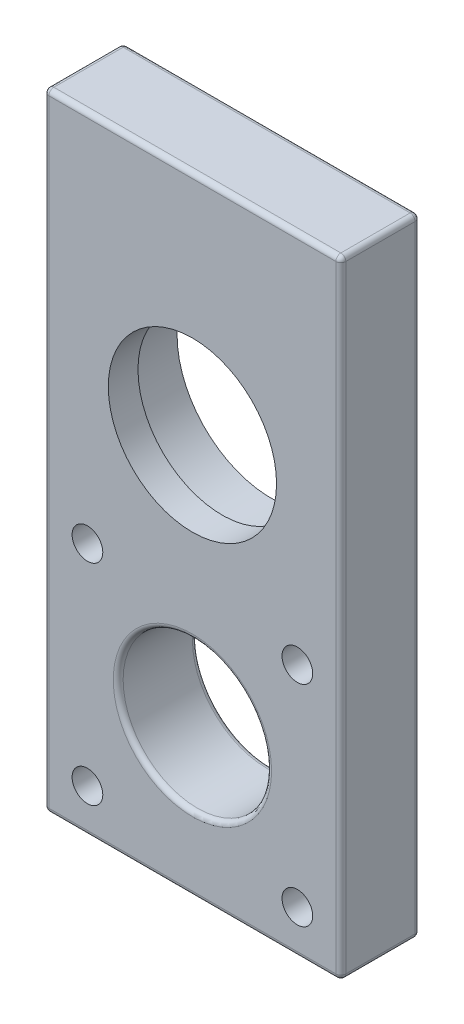
ISO-10303-21;
HEADER;
FILE_DESCRIPTION(('STEP AP214'),'2;1');
FILE_NAME('part.step','',(''),(''),'','','');
FILE_SCHEMA(('AUTOMOTIVE_DESIGN { 1 0 10303 214 1 1 1 1 }'));
ENDSEC;
DATA;
#1=APPLICATION_CONTEXT('core data for automotive mechanical design processes');
#2=APPLICATION_PROTOCOL_DEFINITION('international standard','automotive_design',2000,#1);
#3=PRODUCT_CONTEXT('',#1,'mechanical');
#4=PRODUCT('Part','Part','',(#3));
#5=PRODUCT_RELATED_PRODUCT_CATEGORY('part','',(#4));
#6=PRODUCT_DEFINITION_FORMATION('','',#4);
#7=PRODUCT_DEFINITION_CONTEXT('part definition',#1,'design');
#8=PRODUCT_DEFINITION('design','',#6,#7);
#9=PRODUCT_DEFINITION_SHAPE('','',#8);
#10=(LENGTH_UNIT() NAMED_UNIT(*) SI_UNIT(.MILLI.,.METRE.));
#11=(NAMED_UNIT(*) PLANE_ANGLE_UNIT() SI_UNIT($,.RADIAN.));
#12=(NAMED_UNIT(*) SI_UNIT($,.STERADIAN.) SOLID_ANGLE_UNIT());
#13=UNCERTAINTY_MEASURE_WITH_UNIT(LENGTH_MEASURE(1.E-05),#10,'distance_accuracy_value','');
#14=(GEOMETRIC_REPRESENTATION_CONTEXT(3) GLOBAL_UNCERTAINTY_ASSIGNED_CONTEXT((#13)) GLOBAL_UNIT_ASSIGNED_CONTEXT((#10,
#11,#12)) REPRESENTATION_CONTEXT('',''));
#15=CARTESIAN_POINT('',(0.,0.,0.));
#16=DIRECTION('',(0.,0.,1.));
#17=DIRECTION('',(1.,0.,0.));
#18=AXIS2_PLACEMENT_3D('',#15,#16,#17);
#19=CARTESIAN_POINT('',(10.6066017177984,10.6066017177987,-2.));
#20=DIRECTION('',(0.,0.,1.));
#21=DIRECTION('',(1.,0.,0.));
#22=AXIS2_PLACEMENT_3D('',#19,#20,#21);
#23=CYLINDRICAL_SURFACE('',#22,1.55000000000007);
#24=CARTESIAN_POINT('',(10.6066017177984,10.6066017177987,8.));
#25=DIRECTION('',(0.,0.,1.));
#26=DIRECTION('',(1.,0.,0.));
#27=AXIS2_PLACEMENT_3D('',#24,#25,#26);
#28=CIRCLE('',#27,1.55000000000007);
#29=CARTESIAN_POINT('',(12.1566017177985,10.6066017177987,8.));
#30=VERTEX_POINT('',#29);
#31=EDGE_CURVE('E196',#30,#30,#28,.T.);
#32=ORIENTED_EDGE('',*,*,#31,.T.);
#33=EDGE_LOOP('',(#32));
#34=FACE_BOUND('',#33,.T.);
#35=CARTESIAN_POINT('',(10.6066017177984,10.6066017177987,2.55));
#36=DIRECTION('',(0.,0.,-1.));
#37=DIRECTION('',(-1.,0.,0.));
#38=AXIS2_PLACEMENT_3D('',#35,#36,#37);
#39=CIRCLE('',#38,1.55000000000007);
#40=CARTESIAN_POINT('',(9.05660171779833,10.6066017177987,2.55));
#41=VERTEX_POINT('',#40);
#42=EDGE_CURVE('E41',#41,#41,#39,.F.);
#43=ORIENTED_EDGE('',*,*,#42,.F.);
#44=EDGE_LOOP('',(#43));
#45=FACE_BOUND('',#44,.T.);
#46=ADVANCED_FACE('F37',(#34,#45),#23,.F.);
#47=CARTESIAN_POINT('',(10.6066017177993,-10.6066017177978,-2.));
#48=DIRECTION('',(0.,0.,1.));
#49=DIRECTION('',(1.,0.,0.));
#50=AXIS2_PLACEMENT_3D('',#47,#48,#49);
#51=CYLINDRICAL_SURFACE('',#50,1.55000000000098);
#52=CARTESIAN_POINT('',(10.6066017177993,-10.6066017177978,8.));
#53=DIRECTION('',(0.,0.,1.));
#54=DIRECTION('',(1.,0.,0.));
#55=AXIS2_PLACEMENT_3D('',#52,#53,#54);
#56=CIRCLE('',#55,1.55000000000098);
#57=CARTESIAN_POINT('',(12.1566017178003,-10.6066017177978,8.));
#58=VERTEX_POINT('',#57);
#59=EDGE_CURVE('E303',#58,#58,#56,.T.);
#60=ORIENTED_EDGE('',*,*,#59,.T.);
#61=EDGE_LOOP('',(#60));
#62=FACE_BOUND('',#61,.T.);
#63=CARTESIAN_POINT('',(10.6066017177993,-10.6066017177978,2.55));
#64=DIRECTION('',(0.,0.,-1.));
#65=DIRECTION('',(-1.,0.,0.));
#66=AXIS2_PLACEMENT_3D('',#63,#64,#65);
#67=CIRCLE('',#66,1.55000000000098);
#68=CARTESIAN_POINT('',(9.05660171779832,-10.6066017177978,2.55));
#69=VERTEX_POINT('',#68);
#70=EDGE_CURVE('E283',#69,#69,#67,.F.);
#71=ORIENTED_EDGE('',*,*,#70,.F.);
#72=EDGE_LOOP('',(#71));
#73=FACE_BOUND('',#72,.T.);
#74=ADVANCED_FACE('F328',(#62,#73),#51,.F.);
#75=CARTESIAN_POINT('',(-10.6066017177971,-10.6066017177987,-2.));
#76=DIRECTION('',(0.,0.,1.));
#77=DIRECTION('',(1.,0.,0.));
#78=AXIS2_PLACEMENT_3D('',#75,#76,#77);
#79=CYLINDRICAL_SURFACE('',#78,1.5500000000013);
#80=CARTESIAN_POINT('',(-10.6066017177971,-10.6066017177987,8.));
#81=DIRECTION('',(0.,0.,1.));
#82=DIRECTION('',(1.,0.,0.));
#83=AXIS2_PLACEMENT_3D('',#80,#81,#82);
#84=CIRCLE('',#83,1.5500000000013);
#85=CARTESIAN_POINT('',(-9.05660171779583,-10.6066017177987,8.));
#86=VERTEX_POINT('',#85);
#87=EDGE_CURVE('E306',#86,#86,#84,.T.);
#88=ORIENTED_EDGE('',*,*,#87,.T.);
#89=EDGE_LOOP('',(#88));
#90=FACE_BOUND('',#89,.T.);
#91=CARTESIAN_POINT('',(-10.6066017177971,-10.6066017177987,2.55));
#92=DIRECTION('',(0.,0.,-1.));
#93=DIRECTION('',(-1.,0.,0.));
#94=AXIS2_PLACEMENT_3D('',#91,#92,#93);
#95=CIRCLE('',#94,1.5500000000013);
#96=CARTESIAN_POINT('',(-12.1566017177984,-10.6066017177987,2.55));
#97=VERTEX_POINT('',#96);
#98=EDGE_CURVE('E280',#97,#97,#95,.F.);
#99=ORIENTED_EDGE('',*,*,#98,.F.);
#100=EDGE_LOOP('',(#99));
#101=FACE_BOUND('',#100,.T.);
#102=ADVANCED_FACE('F333',(#90,#101),#79,.F.);
#103=CARTESIAN_POINT('',(-10.606601717798,10.6066017177978,-2.));
#104=DIRECTION('',(0.,0.,1.));
#105=DIRECTION('',(1.,0.,0.));
#106=AXIS2_PLACEMENT_3D('',#103,#104,#105);
#107=CYLINDRICAL_SURFACE('',#106,1.55000000000049);
#108=CARTESIAN_POINT('',(-10.606601717798,10.6066017177978,8.));
#109=DIRECTION('',(0.,0.,1.));
#110=DIRECTION('',(1.,0.,0.));
#111=AXIS2_PLACEMENT_3D('',#108,#109,#110);
#112=CIRCLE('',#111,1.55000000000049);
#113=CARTESIAN_POINT('',(-9.05660171779754,10.6066017177978,8.));
#114=VERTEX_POINT('',#113);
#115=EDGE_CURVE('E272',#114,#114,#112,.T.);
#116=ORIENTED_EDGE('',*,*,#115,.T.);
#117=EDGE_LOOP('',(#116));
#118=FACE_BOUND('',#117,.T.);
#119=CARTESIAN_POINT('',(-10.606601717798,10.6066017177978,2.55));
#120=DIRECTION('',(0.,0.,-1.));
#121=DIRECTION('',(-1.,0.,0.));
#122=AXIS2_PLACEMENT_3D('',#119,#120,#121);
#123=CIRCLE('',#122,1.55000000000049);
#124=CARTESIAN_POINT('',(-12.1566017177985,10.6066017177978,2.55));
#125=VERTEX_POINT('',#124);
#126=EDGE_CURVE('E277',#125,#125,#123,.F.);
#127=ORIENTED_EDGE('',*,*,#126,.F.);
#128=EDGE_LOOP('',(#127));
#129=FACE_BOUND('',#128,.T.);
#130=ADVANCED_FACE('F311',(#118,#129),#107,.F.);
#131=CARTESIAN_POINT('',(0.,25.4,12.));
#132=DIRECTION('',(0.,0.,-1.));
#133=DIRECTION('',(-1.,0.,0.));
#134=AXIS2_PLACEMENT_3D('',#131,#132,#133);
#135=CYLINDRICAL_SURFACE('',#134,8.5);
#136=CARTESIAN_POINT('',(0.,25.4,8.));
#137=DIRECTION('',(0.,0.,1.));
#138=DIRECTION('',(1.,0.,0.));
#139=AXIS2_PLACEMENT_3D('',#136,#137,#138);
#140=CIRCLE('',#139,8.5);
#141=CARTESIAN_POINT('',(8.5,25.4,8.));
#142=VERTEX_POINT('',#141);
#143=EDGE_CURVE('E253',#142,#142,#140,.T.);
#144=ORIENTED_EDGE('',*,*,#143,.T.);
#145=EDGE_LOOP('',(#144));
#146=FACE_BOUND('',#145,.T.);
#147=CARTESIAN_POINT('',(0.,25.4,5.));
#148=DIRECTION('',(0.,0.,-1.));
#149=DIRECTION('',(-1.,0.,0.));
#150=AXIS2_PLACEMENT_3D('',#147,#148,#149);
#151=CIRCLE('',#150,8.5);
#152=CARTESIAN_POINT('',(-8.5,25.4,5.));
#153=VERTEX_POINT('',#152);
#154=EDGE_CURVE('E273',#153,#153,#151,.F.);
#155=ORIENTED_EDGE('',*,*,#154,.F.);
#156=EDGE_LOOP('',(#155));
#157=FACE_BOUND('',#156,.T.);
#158=ADVANCED_FACE('F345',(#146,#157),#135,.F.);
#159=CARTESIAN_POINT('',(-15.,-15.,8.));
#160=DIRECTION('',(-1.,0.,0.));
#161=DIRECTION('',(0.,0.,1.));
#162=AXIS2_PLACEMENT_3D('',#159,#160,#161);
#163=PLANE('',#162);
#164=DIRECTION('',(0.,1.,0.));
#165=VECTOR('',#164,1.);
#166=CARTESIAN_POINT('',(-15.,-15.,7.5));
#167=LINE('',#166,#165);
#168=CARTESIAN_POINT('',(-15.,-14.5,7.5));
#169=VERTEX_POINT('',#168);
#170=CARTESIAN_POINT('',(-15.,47.84,7.5));
#171=VERTEX_POINT('',#170);
#172=EDGE_CURVE('E160',#169,#171,#167,.T.);
#173=ORIENTED_EDGE('',*,*,#172,.T.);
#174=DIRECTION('',(0.,0.,1.));
#175=VECTOR('',#174,1.);
#176=CARTESIAN_POINT('',(-15.,47.84,0.5));
#177=LINE('',#176,#175);
#178=CARTESIAN_POINT('',(-15.,47.84,0.5));
#179=VERTEX_POINT('',#178);
#180=EDGE_CURVE('E245',#171,#179,#177,.F.);
#181=ORIENTED_EDGE('',*,*,#180,.T.);
#182=DIRECTION('',(0.,1.,0.));
#183=VECTOR('',#182,1.);
#184=CARTESIAN_POINT('',(-15.,-15.,0.5));
#185=LINE('',#184,#183);
#186=CARTESIAN_POINT('',(-15.,-14.5,0.5));
#187=VERTEX_POINT('',#186);
#188=EDGE_CURVE('E168',#179,#187,#185,.F.);
#189=ORIENTED_EDGE('',*,*,#188,.T.);
#190=DIRECTION('',(0.,0.,-1.));
#191=VECTOR('',#190,1.);
#192=CARTESIAN_POINT('',(-15.,-14.5,8.));
#193=LINE('',#192,#191);
#194=EDGE_CURVE('E166',#187,#169,#193,.F.);
#195=ORIENTED_EDGE('',*,*,#194,.T.);
#196=EDGE_LOOP('',(#173,#181,#189,#195));
#197=FACE_BOUND('',#196,.T.);
#198=ADVANCED_FACE('F317',(#197),#163,.T.);
#199=CARTESIAN_POINT('',(0.,0.,8.));
#200=DIRECTION('',(0.,0.,1.));
#201=DIRECTION('',(1.,0.,0.));
#202=AXIS2_PLACEMENT_3D('',#199,#200,#201);
#203=PLANE('',#202);
#204=ORIENTED_EDGE('',*,*,#143,.F.);
#205=EDGE_LOOP('',(#204));
#206=FACE_BOUND('',#205,.T.);
#207=DIRECTION('',(0.,1.,0.));
#208=VECTOR('',#207,1.);
#209=CARTESIAN_POINT('',(14.5,49.,8.));
#210=LINE('',#209,#208);
#211=CARTESIAN_POINT('',(14.5,-14.5,8.));
#212=VERTEX_POINT('',#211);
#213=CARTESIAN_POINT('',(14.5,47.84,8.));
#214=VERTEX_POINT('',#213);
#215=EDGE_CURVE('E179',#212,#214,#210,.T.);
#216=ORIENTED_EDGE('',*,*,#215,.T.);
#217=DIRECTION('',(1.,0.,0.));
#218=VECTOR('',#217,1.);
#219=CARTESIAN_POINT('',(-14.5,47.84,8.));
#220=LINE('',#219,#218);
#221=CARTESIAN_POINT('',(-14.5,47.84,8.));
#222=VERTEX_POINT('',#221);
#223=EDGE_CURVE('E241',#214,#222,#220,.F.);
#224=ORIENTED_EDGE('',*,*,#223,.T.);
#225=DIRECTION('',(0.,1.,0.));
#226=VECTOR('',#225,1.);
#227=CARTESIAN_POINT('',(-14.5,0.,8.));
#228=LINE('',#227,#226);
#229=CARTESIAN_POINT('',(-14.5,-14.5,8.));
#230=VERTEX_POINT('',#229);
#231=EDGE_CURVE('E182',#222,#230,#228,.F.);
#232=ORIENTED_EDGE('',*,*,#231,.T.);
#233=DIRECTION('',(1.,0.,0.));
#234=VECTOR('',#233,1.);
#235=CARTESIAN_POINT('',(15.,-14.5,8.));
#236=LINE('',#235,#234);
#237=EDGE_CURVE('E184',#230,#212,#236,.T.);
#238=ORIENTED_EDGE('',*,*,#237,.T.);
#239=EDGE_LOOP('',(#216,#224,#232,#238));
#240=FACE_BOUND('',#239,.T.);
#241=CARTESIAN_POINT('',(0.,0.,8.));
#242=DIRECTION('',(0.,0.,1.));
#243=DIRECTION('',(1.,0.,0.));
#244=AXIS2_PLACEMENT_3D('',#241,#242,#243);
#245=CIRCLE('',#244,8.);
#246=CARTESIAN_POINT('',(8.,0.,8.));
#247=VERTEX_POINT('',#246);
#248=EDGE_CURVE('E224',#247,#247,#245,.F.);
#249=ORIENTED_EDGE('',*,*,#248,.T.);
#250=EDGE_LOOP('',(#249));
#251=FACE_BOUND('',#250,.T.);
#252=ORIENTED_EDGE('',*,*,#115,.F.);
#253=EDGE_LOOP('',(#252));
#254=FACE_BOUND('',#253,.T.);
#255=ORIENTED_EDGE('',*,*,#87,.F.);
#256=EDGE_LOOP('',(#255));
#257=FACE_BOUND('',#256,.T.);
#258=ORIENTED_EDGE('',*,*,#59,.F.);
#259=EDGE_LOOP('',(#258));
#260=FACE_BOUND('',#259,.T.);
#261=ORIENTED_EDGE('',*,*,#31,.F.);
#262=EDGE_LOOP('',(#261));
#263=FACE_BOUND('',#262,.T.);
#264=ADVANCED_FACE('F314',(#206,#240,#251,#254,#257,#260,#263),#203,.T.);
#265=CARTESIAN_POINT('',(0.,0.,0.));
#266=DIRECTION('',(0.,0.,1.));
#267=DIRECTION('',(1.,0.,0.));
#268=AXIS2_PLACEMENT_3D('',#265,#266,#267);
#269=PLANE('',#268);
#270=CARTESIAN_POINT('',(10.6066017177993,-10.6066017177978,0.));
#271=DIRECTION('',(0.,0.,-1.));
#272=DIRECTION('',(-1.,0.,0.));
#273=AXIS2_PLACEMENT_3D('',#270,#271,#272);
#274=CIRCLE('',#273,2.825);
#275=CARTESIAN_POINT('',(7.7816017177993,-10.6066017177978,0.));
#276=VERTEX_POINT('',#275);
#277=EDGE_CURVE('E696',#276,#276,#274,.T.);
#278=ORIENTED_EDGE('',*,*,#277,.F.);
#279=EDGE_LOOP('',(#278));
#280=FACE_BOUND('',#279,.T.);
#281=CARTESIAN_POINT('',(-10.6066017177971,-10.6066017177987,0.));
#282=DIRECTION('',(0.,0.,-1.));
#283=DIRECTION('',(-1.,0.,0.));
#284=AXIS2_PLACEMENT_3D('',#281,#282,#283);
#285=CIRCLE('',#284,2.825);
#286=CARTESIAN_POINT('',(-13.4316017177971,-10.6066017177987,0.));
#287=VERTEX_POINT('',#286);
#288=EDGE_CURVE('E702',#287,#287,#285,.T.);
#289=ORIENTED_EDGE('',*,*,#288,.F.);
#290=EDGE_LOOP('',(#289));
#291=FACE_BOUND('',#290,.T.);
#292=CARTESIAN_POINT('',(-10.606601717798,10.6066017177978,0.));
#293=DIRECTION('',(0.,0.,-1.));
#294=DIRECTION('',(-1.,0.,0.));
#295=AXIS2_PLACEMENT_3D('',#292,#293,#294);
#296=CIRCLE('',#295,2.825);
#297=CARTESIAN_POINT('',(-13.431601717798,10.6066017177978,0.));
#298=VERTEX_POINT('',#297);
#299=EDGE_CURVE('E693',#298,#298,#296,.T.);
#300=ORIENTED_EDGE('',*,*,#299,.F.);
#301=EDGE_LOOP('',(#300));
#302=FACE_BOUND('',#301,.T.);
#303=CARTESIAN_POINT('',(10.6066017177984,10.6066017177987,0.));
#304=DIRECTION('',(0.,0.,-1.));
#305=DIRECTION('',(-1.,0.,0.));
#306=AXIS2_PLACEMENT_3D('',#303,#304,#305);
#307=CIRCLE('',#306,2.825);
#308=CARTESIAN_POINT('',(7.7816017177984,10.6066017177987,0.));
#309=VERTEX_POINT('',#308);
#310=EDGE_CURVE('E688',#309,#309,#307,.T.);
#311=ORIENTED_EDGE('',*,*,#310,.F.);
#312=EDGE_LOOP('',(#311));
#313=FACE_BOUND('',#312,.T.);
#314=CARTESIAN_POINT('',(0.,25.4,0.));
#315=DIRECTION('',(0.,0.,-1.));
#316=DIRECTION('',(-1.,0.,0.));
#317=AXIS2_PLACEMENT_3D('',#314,#315,#316);
#318=CIRCLE('',#317,9.55);
#319=CARTESIAN_POINT('',(-9.55,25.4,0.));
#320=VERTEX_POINT('',#319);
#321=EDGE_CURVE('E288',#320,#320,#318,.T.);
#322=ORIENTED_EDGE('',*,*,#321,.F.);
#323=EDGE_LOOP('',(#322));
#324=FACE_BOUND('',#323,.T.);
#325=CARTESIAN_POINT('',(0.,0.,0.));
#326=DIRECTION('',(0.,0.,1.));
#327=DIRECTION('',(1.,0.,0.));
#328=AXIS2_PLACEMENT_3D('',#325,#326,#327);
#329=CIRCLE('',#328,8.);
#330=CARTESIAN_POINT('',(8.,0.,0.));
#331=VERTEX_POINT('',#330);
#332=EDGE_CURVE('E192',#331,#331,#329,.T.);
#333=ORIENTED_EDGE('',*,*,#332,.T.);
#334=EDGE_LOOP('',(#333));
#335=FACE_BOUND('',#334,.T.);
#336=DIRECTION('',(0.,1.,0.));
#337=VECTOR('',#336,1.);
#338=CARTESIAN_POINT('',(-14.5,49.,0.));
#339=LINE('',#338,#337);
#340=CARTESIAN_POINT('',(-14.5,-14.5,0.));
#341=VERTEX_POINT('',#340);
#342=CARTESIAN_POINT('',(-14.5,47.84,0.));
#343=VERTEX_POINT('',#342);
#344=EDGE_CURVE('E158',#341,#343,#339,.T.);
#345=ORIENTED_EDGE('',*,*,#344,.T.);
#346=DIRECTION('',(-1.,0.,0.));
#347=VECTOR('',#346,1.);
#348=CARTESIAN_POINT('',(0.,47.84,0.));
#349=LINE('',#348,#347);
#350=CARTESIAN_POINT('',(14.5,47.84,0.));
#351=VERTEX_POINT('',#350);
#352=EDGE_CURVE('E46',#343,#351,#349,.F.);
#353=ORIENTED_EDGE('',*,*,#352,.T.);
#354=DIRECTION('',(0.,1.,0.));
#355=VECTOR('',#354,1.);
#356=CARTESIAN_POINT('',(14.5,0.,0.));
#357=LINE('',#356,#355);
#358=CARTESIAN_POINT('',(14.5,-14.5,0.));
#359=VERTEX_POINT('',#358);
#360=EDGE_CURVE('E125',#351,#359,#357,.F.);
#361=ORIENTED_EDGE('',*,*,#360,.T.);
#362=DIRECTION('',(1.,0.,0.));
#363=VECTOR('',#362,1.);
#364=CARTESIAN_POINT('',(0.,-14.5,0.));
#365=LINE('',#364,#363);
#366=EDGE_CURVE('E129',#359,#341,#365,.F.);
#367=ORIENTED_EDGE('',*,*,#366,.T.);
#368=EDGE_LOOP('',(#345,#353,#361,#367));
#369=FACE_BOUND('',#368,.T.);
#370=ADVANCED_FACE('F127',(#280,#291,#302,#313,#324,#335,#369),#269,.F.);
#371=CARTESIAN_POINT('',(-15.,-15.,8.));
#372=DIRECTION('',(0.,1.,0.));
#373=DIRECTION('',(0.,0.,1.));
#374=AXIS2_PLACEMENT_3D('',#371,#372,#373);
#375=PLANE('',#374);
#376=DIRECTION('',(1.,0.,0.));
#377=VECTOR('',#376,1.);
#378=CARTESIAN_POINT('',(-15.,-15.,7.5));
#379=LINE('',#378,#377);
#380=CARTESIAN_POINT('',(14.5,-15.,7.5));
#381=VERTEX_POINT('',#380);
#382=CARTESIAN_POINT('',(-14.5,-15.,7.5));
#383=VERTEX_POINT('',#382);
#384=EDGE_CURVE('E172',#381,#383,#379,.F.);
#385=ORIENTED_EDGE('',*,*,#384,.T.);
#386=DIRECTION('',(0.,0.,-1.));
#387=VECTOR('',#386,1.);
#388=CARTESIAN_POINT('',(-14.5,-15.,0.));
#389=LINE('',#388,#387);
#390=CARTESIAN_POINT('',(-14.5,-15.,0.5));
#391=VERTEX_POINT('',#390);
#392=EDGE_CURVE('E176',#383,#391,#389,.T.);
#393=ORIENTED_EDGE('',*,*,#392,.T.);
#394=DIRECTION('',(1.,0.,0.));
#395=VECTOR('',#394,1.);
#396=CARTESIAN_POINT('',(-15.,-15.,0.5));
#397=LINE('',#396,#395);
#398=CARTESIAN_POINT('',(14.5,-15.,0.5));
#399=VERTEX_POINT('',#398);
#400=EDGE_CURVE('E174',#391,#399,#397,.T.);
#401=ORIENTED_EDGE('',*,*,#400,.T.);
#402=DIRECTION('',(0.,0.,-1.));
#403=VECTOR('',#402,1.);
#404=CARTESIAN_POINT('',(14.5,-15.,8.));
#405=LINE('',#404,#403);
#406=EDGE_CURVE('E170',#399,#381,#405,.F.);
#407=ORIENTED_EDGE('',*,*,#406,.T.);
#408=EDGE_LOOP('',(#385,#393,#401,#407));
#409=FACE_BOUND('',#408,.T.);
#410=ADVANCED_FACE('F354',(#409),#375,.F.);
#411=CARTESIAN_POINT('',(15.,-15.,8.));
#412=DIRECTION('',(-1.,0.,0.));
#413=DIRECTION('',(0.,0.,1.));
#414=AXIS2_PLACEMENT_3D('',#411,#412,#413);
#415=PLANE('',#414);
#416=DIRECTION('',(0.,1.,0.));
#417=VECTOR('',#416,1.);
#418=CARTESIAN_POINT('',(15.,-15.,0.5));
#419=LINE('',#418,#417);
#420=CARTESIAN_POINT('',(15.,-14.5,0.5));
#421=VERTEX_POINT('',#420);
#422=CARTESIAN_POINT('',(15.,47.84,0.5));
#423=VERTEX_POINT('',#422);
#424=EDGE_CURVE('E141',#421,#423,#419,.T.);
#425=ORIENTED_EDGE('',*,*,#424,.T.);
#426=DIRECTION('',(0.,0.,-1.));
#427=VECTOR('',#426,1.);
#428=CARTESIAN_POINT('',(15.,47.84,8.));
#429=LINE('',#428,#427);
#430=CARTESIAN_POINT('',(15.,47.84,7.5));
#431=VERTEX_POINT('',#430);
#432=EDGE_CURVE('E236',#423,#431,#429,.F.);
#433=ORIENTED_EDGE('',*,*,#432,.T.);
#434=DIRECTION('',(0.,1.,0.));
#435=VECTOR('',#434,1.);
#436=CARTESIAN_POINT('',(15.,-15.,7.5));
#437=LINE('',#436,#435);
#438=CARTESIAN_POINT('',(15.,-14.5,7.5));
#439=VERTEX_POINT('',#438);
#440=EDGE_CURVE('E190',#431,#439,#437,.F.);
#441=ORIENTED_EDGE('',*,*,#440,.T.);
#442=DIRECTION('',(0.,0.,-1.));
#443=VECTOR('',#442,1.);
#444=CARTESIAN_POINT('',(15.,-14.5,8.));
#445=LINE('',#444,#443);
#446=EDGE_CURVE('E188',#439,#421,#445,.T.);
#447=ORIENTED_EDGE('',*,*,#446,.T.);
#448=EDGE_LOOP('',(#425,#433,#441,#447));
#449=FACE_BOUND('',#448,.T.);
#450=ADVANCED_FACE('F359',(#449),#415,.F.);
#451=CARTESIAN_POINT('',(14.5,0.,7.5));
#452=DIRECTION('',(0.,-1.,0.));
#453=DIRECTION('',(0.,0.,-1.));
#454=AXIS2_PLACEMENT_3D('',#451,#452,#453);
#455=CYLINDRICAL_SURFACE('',#454,0.5);
#456=ORIENTED_EDGE('',*,*,#440,.F.);
#457=CARTESIAN_POINT('',(14.5,47.84,7.5));
#458=DIRECTION('',(0.,-1.,0.));
#459=DIRECTION('',(0.,0.,-1.));
#460=AXIS2_PLACEMENT_3D('',#457,#458,#459);
#461=CIRCLE('',#460,0.5);
#462=EDGE_CURVE('E238',#431,#214,#461,.T.);
#463=ORIENTED_EDGE('',*,*,#462,.T.);
#464=ORIENTED_EDGE('',*,*,#215,.F.);
#465=CARTESIAN_POINT('',(14.5,-14.5,7.5));
#466=DIRECTION('',(0.,-1.,0.));
#467=DIRECTION('',(0.,0.,-1.));
#468=AXIS2_PLACEMENT_3D('',#465,#466,#467);
#469=CIRCLE('',#468,0.5);
#470=EDGE_CURVE('E133',#439,#212,#469,.T.);
#471=ORIENTED_EDGE('',*,*,#470,.F.);
#472=EDGE_LOOP('',(#456,#463,#464,#471));
#473=FACE_BOUND('',#472,.T.);
#474=ADVANCED_FACE('F362',(#473),#455,.T.);
#475=CARTESIAN_POINT('',(14.5,-14.5,7.5));
#476=DIRECTION('',(0.,0.,1.));
#477=DIRECTION('',(1.,0.,0.));
#478=AXIS2_PLACEMENT_3D('',#475,#476,#477);
#479=SPHERICAL_SURFACE('',#478,0.5);
#480=CARTESIAN_POINT('',(14.5,-14.5,7.5));
#481=DIRECTION('',(0.,0.,1.));
#482=DIRECTION('',(1.,0.,0.));
#483=AXIS2_PLACEMENT_3D('',#480,#481,#482);
#484=CIRCLE('',#483,0.5);
#485=EDGE_CURVE('E209',#439,#381,#484,.F.);
#486=ORIENTED_EDGE('',*,*,#485,.F.);
#487=ORIENTED_EDGE('',*,*,#470,.T.);
#488=CARTESIAN_POINT('',(14.5,-14.5,7.5));
#489=DIRECTION('',(1.,0.,0.));
#490=DIRECTION('',(0.,0.,-1.));
#491=AXIS2_PLACEMENT_3D('',#488,#489,#490);
#492=CIRCLE('',#491,0.5);
#493=EDGE_CURVE('E212',#381,#212,#492,.F.);
#494=ORIENTED_EDGE('',*,*,#493,.F.);
#495=EDGE_LOOP('',(#486,#487,#494));
#496=FACE_BOUND('',#495,.T.);
#497=ADVANCED_FACE('F398',(#496),#479,.T.);
#498=CARTESIAN_POINT('',(-14.5,-15.,7.5));
#499=DIRECTION('',(0.,1.,0.));
#500=DIRECTION('',(0.,0.,1.));
#501=AXIS2_PLACEMENT_3D('',#498,#499,#500);
#502=CYLINDRICAL_SURFACE('',#501,0.5);
#503=ORIENTED_EDGE('',*,*,#231,.F.);
#504=CARTESIAN_POINT('',(-14.5,47.84,7.5));
#505=DIRECTION('',(0.,1.,0.));
#506=DIRECTION('',(0.,0.,1.));
#507=AXIS2_PLACEMENT_3D('',#504,#505,#506);
#508=CIRCLE('',#507,0.5);
#509=EDGE_CURVE('E243',#222,#171,#508,.F.);
#510=ORIENTED_EDGE('',*,*,#509,.T.);
#511=ORIENTED_EDGE('',*,*,#172,.F.);
#512=CARTESIAN_POINT('',(-14.5,-14.5,7.5));
#513=DIRECTION('',(0.,-1.,0.));
#514=DIRECTION('',(0.,0.,-1.));
#515=AXIS2_PLACEMENT_3D('',#512,#513,#514);
#516=CIRCLE('',#515,0.5);
#517=EDGE_CURVE('E206',#230,#169,#516,.T.);
#518=ORIENTED_EDGE('',*,*,#517,.F.);
#519=EDGE_LOOP('',(#503,#510,#511,#518));
#520=FACE_BOUND('',#519,.T.);
#521=ADVANCED_FACE('F394',(#520),#502,.T.);
#522=CARTESIAN_POINT('',(0.,-14.5,7.5));
#523=DIRECTION('',(-1.,0.,0.));
#524=DIRECTION('',(0.,0.,1.));
#525=AXIS2_PLACEMENT_3D('',#522,#523,#524);
#526=CYLINDRICAL_SURFACE('',#525,0.5);
#527=ORIENTED_EDGE('',*,*,#493,.T.);
#528=ORIENTED_EDGE('',*,*,#237,.F.);
#529=CARTESIAN_POINT('',(-14.5,-14.5,7.5));
#530=DIRECTION('',(-1.,0.,0.));
#531=DIRECTION('',(0.,0.,1.));
#532=AXIS2_PLACEMENT_3D('',#529,#530,#531);
#533=CIRCLE('',#532,0.5);
#534=EDGE_CURVE('E203',#383,#230,#533,.T.);
#535=ORIENTED_EDGE('',*,*,#534,.F.);
#536=ORIENTED_EDGE('',*,*,#384,.F.);
#537=EDGE_LOOP('',(#527,#528,#535,#536));
#538=FACE_BOUND('',#537,.T.);
#539=ADVANCED_FACE('F390',(#538),#526,.T.);
#540=CARTESIAN_POINT('',(14.5,-14.5,8.));
#541=DIRECTION('',(0.,0.,-1.));
#542=DIRECTION('',(-1.,0.,0.));
#543=AXIS2_PLACEMENT_3D('',#540,#541,#542);
#544=CYLINDRICAL_SURFACE('',#543,0.5);
#545=ORIENTED_EDGE('',*,*,#485,.T.);
#546=ORIENTED_EDGE('',*,*,#406,.F.);
#547=CARTESIAN_POINT('',(14.5,-14.5,0.5));
#548=DIRECTION('',(0.,0.,-1.));
#549=DIRECTION('',(-1.,0.,0.));
#550=AXIS2_PLACEMENT_3D('',#547,#548,#549);
#551=CIRCLE('',#550,0.5);
#552=EDGE_CURVE('E150',#421,#399,#551,.T.);
#553=ORIENTED_EDGE('',*,*,#552,.F.);
#554=ORIENTED_EDGE('',*,*,#446,.F.);
#555=EDGE_LOOP('',(#545,#546,#553,#554));
#556=FACE_BOUND('',#555,.T.);
#557=ADVANCED_FACE('F386',(#556),#544,.T.);
#558=CARTESIAN_POINT('',(-14.5,-14.5,7.5));
#559=DIRECTION('',(0.,0.,1.));
#560=DIRECTION('',(1.,0.,0.));
#561=AXIS2_PLACEMENT_3D('',#558,#559,#560);
#562=SPHERICAL_SURFACE('',#561,0.5);
#563=ORIENTED_EDGE('',*,*,#534,.T.);
#564=ORIENTED_EDGE('',*,*,#517,.T.);
#565=CARTESIAN_POINT('',(-14.5,-14.5,7.5));
#566=DIRECTION('',(0.,0.,1.));
#567=DIRECTION('',(1.,0.,0.));
#568=AXIS2_PLACEMENT_3D('',#565,#566,#567);
#569=CIRCLE('',#568,0.5);
#570=EDGE_CURVE('E153',#383,#169,#569,.F.);
#571=ORIENTED_EDGE('',*,*,#570,.F.);
#572=EDGE_LOOP('',(#563,#564,#571));
#573=FACE_BOUND('',#572,.T.);
#574=ADVANCED_FACE('F383',(#573),#562,.T.);
#575=CARTESIAN_POINT('',(14.5,-14.5,0.5));
#576=DIRECTION('',(0.,0.,1.));
#577=DIRECTION('',(1.,0.,0.));
#578=AXIS2_PLACEMENT_3D('',#575,#576,#577);
#579=SPHERICAL_SURFACE('',#578,0.5);
#580=CARTESIAN_POINT('',(14.5,-14.5,0.5));
#581=DIRECTION('',(0.,-1.,0.));
#582=DIRECTION('',(0.,0.,-1.));
#583=AXIS2_PLACEMENT_3D('',#580,#581,#582);
#584=CIRCLE('',#583,0.5);
#585=EDGE_CURVE('E137',#421,#359,#584,.F.);
#586=ORIENTED_EDGE('',*,*,#585,.F.);
#587=ORIENTED_EDGE('',*,*,#552,.T.);
#588=CARTESIAN_POINT('',(14.5,-14.5,0.5));
#589=DIRECTION('',(1.,0.,0.));
#590=DIRECTION('',(0.,0.,-1.));
#591=AXIS2_PLACEMENT_3D('',#588,#589,#590);
#592=CIRCLE('',#591,0.5);
#593=EDGE_CURVE('E144',#359,#399,#592,.F.);
#594=ORIENTED_EDGE('',*,*,#593,.F.);
#595=EDGE_LOOP('',(#586,#587,#594));
#596=FACE_BOUND('',#595,.T.);
#597=ADVANCED_FACE('F148',(#596),#579,.T.);
#598=CARTESIAN_POINT('',(-14.5,-14.5,8.));
#599=DIRECTION('',(0.,0.,1.));
#600=DIRECTION('',(1.,0.,0.));
#601=AXIS2_PLACEMENT_3D('',#598,#599,#600);
#602=CYLINDRICAL_SURFACE('',#601,0.5);
#603=ORIENTED_EDGE('',*,*,#570,.T.);
#604=ORIENTED_EDGE('',*,*,#194,.F.);
#605=CARTESIAN_POINT('',(-14.5,-14.5,0.5));
#606=DIRECTION('',(0.,0.,-1.));
#607=DIRECTION('',(-1.,0.,0.));
#608=AXIS2_PLACEMENT_3D('',#605,#606,#607);
#609=CIRCLE('',#608,0.5);
#610=EDGE_CURVE('E145',#391,#187,#609,.T.);
#611=ORIENTED_EDGE('',*,*,#610,.F.);
#612=ORIENTED_EDGE('',*,*,#392,.F.);
#613=EDGE_LOOP('',(#603,#604,#611,#612));
#614=FACE_BOUND('',#613,.T.);
#615=ADVANCED_FACE('F377',(#614),#602,.T.);
#616=CARTESIAN_POINT('',(-15.,-14.5,0.5));
#617=DIRECTION('',(1.,0.,0.));
#618=DIRECTION('',(0.,0.,-1.));
#619=AXIS2_PLACEMENT_3D('',#616,#617,#618);
#620=CYLINDRICAL_SURFACE('',#619,0.5);
#621=ORIENTED_EDGE('',*,*,#593,.T.);
#622=ORIENTED_EDGE('',*,*,#400,.F.);
#623=CARTESIAN_POINT('',(-14.5,-14.5,0.5));
#624=DIRECTION('',(-1.,0.,0.));
#625=DIRECTION('',(0.,0.,1.));
#626=AXIS2_PLACEMENT_3D('',#623,#624,#625);
#627=CIRCLE('',#626,0.5);
#628=EDGE_CURVE('E156',#341,#391,#627,.T.);
#629=ORIENTED_EDGE('',*,*,#628,.F.);
#630=ORIENTED_EDGE('',*,*,#366,.F.);
#631=EDGE_LOOP('',(#621,#622,#629,#630));
#632=FACE_BOUND('',#631,.T.);
#633=ADVANCED_FACE('F155',(#632),#620,.T.);
#634=CARTESIAN_POINT('',(14.5,-15.,0.5));
#635=DIRECTION('',(0.,1.,0.));
#636=DIRECTION('',(0.,0.,1.));
#637=AXIS2_PLACEMENT_3D('',#634,#635,#636);
#638=CYLINDRICAL_SURFACE('',#637,0.5);
#639=ORIENTED_EDGE('',*,*,#360,.F.);
#640=CARTESIAN_POINT('',(14.5,47.84,0.5));
#641=DIRECTION('',(0.,1.,0.));
#642=DIRECTION('',(0.,0.,1.));
#643=AXIS2_PLACEMENT_3D('',#640,#641,#642);
#644=CIRCLE('',#643,0.5);
#645=EDGE_CURVE('E11',#351,#423,#644,.F.);
#646=ORIENTED_EDGE('',*,*,#645,.T.);
#647=ORIENTED_EDGE('',*,*,#424,.F.);
#648=ORIENTED_EDGE('',*,*,#585,.T.);
#649=EDGE_LOOP('',(#639,#646,#647,#648));
#650=FACE_BOUND('',#649,.T.);
#651=ADVANCED_FACE('F139',(#650),#638,.T.);
#652=CARTESIAN_POINT('',(-14.5,-14.5,0.5));
#653=DIRECTION('',(0.,0.,1.));
#654=DIRECTION('',(1.,0.,0.));
#655=AXIS2_PLACEMENT_3D('',#652,#653,#654);
#656=SPHERICAL_SURFACE('',#655,0.5);
#657=ORIENTED_EDGE('',*,*,#628,.T.);
#658=ORIENTED_EDGE('',*,*,#610,.T.);
#659=CARTESIAN_POINT('',(-14.5,-14.5,0.5));
#660=DIRECTION('',(0.,-1.,0.));
#661=DIRECTION('',(0.,0.,-1.));
#662=AXIS2_PLACEMENT_3D('',#659,#660,#661);
#663=CIRCLE('',#662,0.5);
#664=EDGE_CURVE('E193',#341,#187,#663,.F.);
#665=ORIENTED_EDGE('',*,*,#664,.F.);
#666=EDGE_LOOP('',(#657,#658,#665));
#667=FACE_BOUND('',#666,.T.);
#668=ADVANCED_FACE('F369',(#667),#656,.T.);
#669=CARTESIAN_POINT('',(-14.5,0.,0.5));
#670=DIRECTION('',(0.,-1.,0.));
#671=DIRECTION('',(0.,0.,-1.));
#672=AXIS2_PLACEMENT_3D('',#669,#670,#671);
#673=CYLINDRICAL_SURFACE('',#672,0.5);
#674=ORIENTED_EDGE('',*,*,#188,.F.);
#675=CARTESIAN_POINT('',(-14.5,47.84,0.5));
#676=DIRECTION('',(0.,-1.,0.));
#677=DIRECTION('',(0.,0.,-1.));
#678=AXIS2_PLACEMENT_3D('',#675,#676,#677);
#679=CIRCLE('',#678,0.5);
#680=EDGE_CURVE('E61',#179,#343,#679,.T.);
#681=ORIENTED_EDGE('',*,*,#680,.T.);
#682=ORIENTED_EDGE('',*,*,#344,.F.);
#683=ORIENTED_EDGE('',*,*,#664,.T.);
#684=EDGE_LOOP('',(#674,#681,#682,#683));
#685=FACE_BOUND('',#684,.T.);
#686=ADVANCED_FACE('F349',(#685),#673,.T.);
#687=CARTESIAN_POINT('',(0.,0.,-2.));
#688=DIRECTION('',(0.,0.,1.));
#689=DIRECTION('',(1.,0.,0.));
#690=AXIS2_PLACEMENT_3D('',#687,#688,#689);
#691=CYLINDRICAL_SURFACE('',#690,7.5);
#692=CARTESIAN_POINT('',(0.,0.,7.5));
#693=DIRECTION('',(0.,0.,1.));
#694=DIRECTION('',(1.,0.,0.));
#695=AXIS2_PLACEMENT_3D('',#692,#693,#694);
#696=CIRCLE('',#695,7.5);
#697=CARTESIAN_POINT('',(7.5,0.,7.5));
#698=VERTEX_POINT('',#697);
#699=EDGE_CURVE('E221',#698,#698,#696,.T.);
#700=ORIENTED_EDGE('',*,*,#699,.T.);
#701=EDGE_LOOP('',(#700));
#702=FACE_BOUND('',#701,.T.);
#703=CARTESIAN_POINT('',(0.,0.,0.5));
#704=DIRECTION('',(0.,0.,1.));
#705=DIRECTION('',(1.,0.,0.));
#706=AXIS2_PLACEMENT_3D('',#703,#704,#705);
#707=CIRCLE('',#706,7.5);
#708=CARTESIAN_POINT('',(7.5,0.,0.5));
#709=VERTEX_POINT('',#708);
#710=EDGE_CURVE('E218',#709,#709,#707,.F.);
#711=ORIENTED_EDGE('',*,*,#710,.T.);
#712=EDGE_LOOP('',(#711));
#713=FACE_BOUND('',#712,.T.);
#714=ADVANCED_FACE('F346',(#702,#713),#691,.F.);
#715=CARTESIAN_POINT('',(0.,0.,0.5));
#716=DIRECTION('',(0.,0.,1.));
#717=DIRECTION('',(1.,0.,0.));
#718=AXIS2_PLACEMENT_3D('',#715,#716,#717);
#719=TOROIDAL_SURFACE('',#718,8.,0.5);
#720=ORIENTED_EDGE('',*,*,#710,.F.);
#721=EDGE_LOOP('',(#720));
#722=FACE_BOUND('',#721,.T.);
#723=ORIENTED_EDGE('',*,*,#332,.F.);
#724=EDGE_LOOP('',(#723));
#725=FACE_BOUND('',#724,.T.);
#726=ADVANCED_FACE('F348',(#722,#725),#719,.T.);
#727=CARTESIAN_POINT('',(0.,0.,7.5));
#728=DIRECTION('',(0.,0.,1.));
#729=DIRECTION('',(1.,0.,0.));
#730=AXIS2_PLACEMENT_3D('',#727,#728,#729);
#731=TOROIDAL_SURFACE('',#730,8.,0.5);
#732=ORIENTED_EDGE('',*,*,#248,.F.);
#733=EDGE_LOOP('',(#732));
#734=FACE_BOUND('',#733,.T.);
#735=ORIENTED_EDGE('',*,*,#699,.F.);
#736=EDGE_LOOP('',(#735));
#737=FACE_BOUND('',#736,.T.);
#738=ADVANCED_FACE('F408',(#734,#737),#731,.T.);
#739=CARTESIAN_POINT('',(-17.6450571264724,48.34,10.));
#740=DIRECTION('',(0.,-1.,0.));
#741=DIRECTION('',(0.,0.,-1.));
#742=AXIS2_PLACEMENT_3D('',#739,#740,#741);
#743=PLANE('',#742);
#744=DIRECTION('',(1.,0.,0.));
#745=VECTOR('',#744,1.);
#746=CARTESIAN_POINT('',(14.5,48.34,7.5));
#747=LINE('',#746,#745);
#748=CARTESIAN_POINT('',(-14.5,48.34,7.5));
#749=VERTEX_POINT('',#748);
#750=CARTESIAN_POINT('',(14.5,48.34,7.5));
#751=VERTEX_POINT('',#750);
#752=EDGE_CURVE('E231',#749,#751,#747,.T.);
#753=ORIENTED_EDGE('',*,*,#752,.T.);
#754=DIRECTION('',(0.,0.,-1.));
#755=VECTOR('',#754,1.);
#756=CARTESIAN_POINT('',(14.5,48.34,10.));
#757=LINE('',#756,#755);
#758=CARTESIAN_POINT('',(14.5,48.34,0.5));
#759=VERTEX_POINT('',#758);
#760=EDGE_CURVE('E233',#751,#759,#757,.T.);
#761=ORIENTED_EDGE('',*,*,#760,.T.);
#762=DIRECTION('',(-1.,0.,0.));
#763=VECTOR('',#762,1.);
#764=CARTESIAN_POINT('',(-17.6450571264724,48.34,0.5));
#765=LINE('',#764,#763);
#766=CARTESIAN_POINT('',(-14.5,48.34,0.5));
#767=VERTEX_POINT('',#766);
#768=EDGE_CURVE('E227',#759,#767,#765,.T.);
#769=ORIENTED_EDGE('',*,*,#768,.T.);
#770=DIRECTION('',(0.,0.,1.));
#771=VECTOR('',#770,1.);
#772=CARTESIAN_POINT('',(-14.5,48.34,7.5));
#773=LINE('',#772,#771);
#774=EDGE_CURVE('E229',#767,#749,#773,.T.);
#775=ORIENTED_EDGE('',*,*,#774,.T.);
#776=EDGE_LOOP('',(#753,#761,#769,#775));
#777=FACE_BOUND('',#776,.T.);
#778=ADVANCED_FACE('F337',(#777),#743,.F.);
#779=CARTESIAN_POINT('',(-14.5,47.84,0.5));
#780=DIRECTION('',(0.,-1.,0.));
#781=DIRECTION('',(0.,0.,-1.));
#782=AXIS2_PLACEMENT_3D('',#779,#780,#781);
#783=SPHERICAL_SURFACE('',#782,0.5);
#784=CARTESIAN_POINT('',(-14.5,47.84,0.5));
#785=DIRECTION('',(1.,0.,0.));
#786=DIRECTION('',(0.,0.,-1.));
#787=AXIS2_PLACEMENT_3D('',#784,#785,#786);
#788=CIRCLE('',#787,0.5);
#789=EDGE_CURVE('E266',#343,#767,#788,.T.);
#790=ORIENTED_EDGE('',*,*,#789,.F.);
#791=ORIENTED_EDGE('',*,*,#680,.F.);
#792=CARTESIAN_POINT('',(-14.5,47.84,0.5));
#793=DIRECTION('',(0.,0.,1.));
#794=DIRECTION('',(1.,0.,0.));
#795=AXIS2_PLACEMENT_3D('',#792,#793,#794);
#796=CIRCLE('',#795,0.5);
#797=EDGE_CURVE('E269',#767,#179,#796,.T.);
#798=ORIENTED_EDGE('',*,*,#797,.F.);
#799=EDGE_LOOP('',(#790,#791,#798));
#800=FACE_BOUND('',#799,.T.);
#801=ADVANCED_FACE('F39',(#800),#783,.T.);
#802=CARTESIAN_POINT('',(-14.5,47.84,10.));
#803=DIRECTION('',(0.,0.,-1.));
#804=DIRECTION('',(-1.,0.,0.));
#805=AXIS2_PLACEMENT_3D('',#802,#803,#804);
#806=CYLINDRICAL_SURFACE('',#805,0.5);
#807=ORIENTED_EDGE('',*,*,#797,.T.);
#808=ORIENTED_EDGE('',*,*,#180,.F.);
#809=CARTESIAN_POINT('',(-14.5,47.84,7.5));
#810=DIRECTION('',(0.,0.,1.));
#811=DIRECTION('',(1.,0.,0.));
#812=AXIS2_PLACEMENT_3D('',#809,#810,#811);
#813=CIRCLE('',#812,0.5);
#814=EDGE_CURVE('E263',#749,#171,#813,.T.);
#815=ORIENTED_EDGE('',*,*,#814,.F.);
#816=ORIENTED_EDGE('',*,*,#774,.F.);
#817=EDGE_LOOP('',(#807,#808,#815,#816));
#818=FACE_BOUND('',#817,.T.);
#819=ADVANCED_FACE('F436',(#818),#806,.T.);
#820=CARTESIAN_POINT('',(-17.6450571264724,47.84,0.5));
#821=DIRECTION('',(-1.,0.,0.));
#822=DIRECTION('',(0.,0.,1.));
#823=AXIS2_PLACEMENT_3D('',#820,#821,#822);
#824=CYLINDRICAL_SURFACE('',#823,0.5);
#825=ORIENTED_EDGE('',*,*,#789,.T.);
#826=ORIENTED_EDGE('',*,*,#768,.F.);
#827=CARTESIAN_POINT('',(14.5,47.84,0.5));
#828=DIRECTION('',(1.,0.,0.));
#829=DIRECTION('',(0.,0.,-1.));
#830=AXIS2_PLACEMENT_3D('',#827,#828,#829);
#831=CIRCLE('',#830,0.5);
#832=EDGE_CURVE('E260',#351,#759,#831,.T.);
#833=ORIENTED_EDGE('',*,*,#832,.F.);
#834=ORIENTED_EDGE('',*,*,#352,.F.);
#835=EDGE_LOOP('',(#825,#826,#833,#834));
#836=FACE_BOUND('',#835,.T.);
#837=ADVANCED_FACE('F433',(#836),#824,.T.);
#838=CARTESIAN_POINT('',(-14.5,47.84,7.5));
#839=DIRECTION('',(0.,-1.,0.));
#840=DIRECTION('',(0.,0.,-1.));
#841=AXIS2_PLACEMENT_3D('',#838,#839,#840);
#842=SPHERICAL_SURFACE('',#841,0.5);
#843=ORIENTED_EDGE('',*,*,#814,.T.);
#844=ORIENTED_EDGE('',*,*,#509,.F.);
#845=CARTESIAN_POINT('',(-14.5,47.84,7.5));
#846=DIRECTION('',(1.,0.,0.));
#847=DIRECTION('',(0.,0.,-1.));
#848=AXIS2_PLACEMENT_3D('',#845,#846,#847);
#849=CIRCLE('',#848,0.5);
#850=EDGE_CURVE('E257',#749,#222,#849,.T.);
#851=ORIENTED_EDGE('',*,*,#850,.F.);
#852=EDGE_LOOP('',(#843,#844,#851));
#853=FACE_BOUND('',#852,.T.);
#854=ADVANCED_FACE('F429',(#853),#842,.T.);
#855=CARTESIAN_POINT('',(14.5,47.84,0.5));
#856=DIRECTION('',(0.,-1.,0.));
#857=DIRECTION('',(0.,0.,-1.));
#858=AXIS2_PLACEMENT_3D('',#855,#856,#857);
#859=SPHERICAL_SURFACE('',#858,0.5);
#860=ORIENTED_EDGE('',*,*,#645,.F.);
#861=ORIENTED_EDGE('',*,*,#832,.T.);
#862=CARTESIAN_POINT('',(14.5,47.84,0.5));
#863=DIRECTION('',(0.,0.,1.));
#864=DIRECTION('',(1.,0.,0.));
#865=AXIS2_PLACEMENT_3D('',#862,#863,#864);
#866=CIRCLE('',#865,0.5);
#867=EDGE_CURVE('E255',#423,#759,#866,.T.);
#868=ORIENTED_EDGE('',*,*,#867,.F.);
#869=EDGE_LOOP('',(#860,#861,#868));
#870=FACE_BOUND('',#869,.T.);
#871=ADVANCED_FACE('F425',(#870),#859,.T.);
#872=CARTESIAN_POINT('',(-17.6450571264724,47.84,7.5));
#873=DIRECTION('',(-1.,0.,0.));
#874=DIRECTION('',(0.,0.,1.));
#875=AXIS2_PLACEMENT_3D('',#872,#873,#874);
#876=CYLINDRICAL_SURFACE('',#875,0.5);
#877=ORIENTED_EDGE('',*,*,#850,.T.);
#878=ORIENTED_EDGE('',*,*,#223,.F.);
#879=CARTESIAN_POINT('',(14.5,47.84,7.5));
#880=DIRECTION('',(1.,0.,0.));
#881=DIRECTION('',(0.,0.,-1.));
#882=AXIS2_PLACEMENT_3D('',#879,#880,#881);
#883=CIRCLE('',#882,0.5);
#884=EDGE_CURVE('E252',#751,#214,#883,.T.);
#885=ORIENTED_EDGE('',*,*,#884,.F.);
#886=ORIENTED_EDGE('',*,*,#752,.F.);
#887=EDGE_LOOP('',(#877,#878,#885,#886));
#888=FACE_BOUND('',#887,.T.);
#889=ADVANCED_FACE('F421',(#888),#876,.T.);
#890=CARTESIAN_POINT('',(14.5,47.84,10.));
#891=DIRECTION('',(0.,0.,-1.));
#892=DIRECTION('',(-1.,0.,0.));
#893=AXIS2_PLACEMENT_3D('',#890,#891,#892);
#894=CYLINDRICAL_SURFACE('',#893,0.5);
#895=ORIENTED_EDGE('',*,*,#867,.T.);
#896=ORIENTED_EDGE('',*,*,#760,.F.);
#897=CARTESIAN_POINT('',(14.5,47.84,7.5));
#898=DIRECTION('',(0.,0.,1.));
#899=DIRECTION('',(1.,0.,0.));
#900=AXIS2_PLACEMENT_3D('',#897,#898,#899);
#901=CIRCLE('',#900,0.5);
#902=EDGE_CURVE('E249',#431,#751,#901,.T.);
#903=ORIENTED_EDGE('',*,*,#902,.F.);
#904=ORIENTED_EDGE('',*,*,#432,.F.);
#905=EDGE_LOOP('',(#895,#896,#903,#904));
#906=FACE_BOUND('',#905,.T.);
#907=ADVANCED_FACE('F417',(#906),#894,.T.);
#908=CARTESIAN_POINT('',(14.5,47.84,7.5));
#909=DIRECTION('',(0.,-1.,0.));
#910=DIRECTION('',(0.,0.,-1.));
#911=AXIS2_PLACEMENT_3D('',#908,#909,#910);
#912=SPHERICAL_SURFACE('',#911,0.5);
#913=ORIENTED_EDGE('',*,*,#884,.T.);
#914=ORIENTED_EDGE('',*,*,#462,.F.);
#915=ORIENTED_EDGE('',*,*,#902,.T.);
#916=EDGE_LOOP('',(#913,#914,#915));
#917=FACE_BOUND('',#916,.T.);
#918=ADVANCED_FACE('F413',(#917),#912,.T.);
#919=CARTESIAN_POINT('',(0.,25.4,5.));
#920=DIRECTION('',(0.,0.,-1.));
#921=DIRECTION('',(-1.,0.,0.));
#922=AXIS2_PLACEMENT_3D('',#919,#920,#921);
#923=PLANE('',#922);
#924=CARTESIAN_POINT('',(0.,25.4,5.));
#925=DIRECTION('',(0.,0.,-1.));
#926=DIRECTION('',(-1.,0.,0.));
#927=AXIS2_PLACEMENT_3D('',#924,#925,#926);
#928=CIRCLE('',#927,9.55);
#929=CARTESIAN_POINT('',(-9.55,25.4,5.));
#930=VERTEX_POINT('',#929);
#931=EDGE_CURVE('E276',#930,#930,#928,.T.);
#932=ORIENTED_EDGE('',*,*,#931,.T.);
#933=EDGE_LOOP('',(#932));
#934=FACE_BOUND('',#933,.T.);
#935=ORIENTED_EDGE('',*,*,#154,.T.);
#936=EDGE_LOOP('',(#935));
#937=FACE_BOUND('',#936,.T.);
#938=ADVANCED_FACE('F416',(#934,#937),#923,.T.);
#939=CARTESIAN_POINT('',(0.,25.4,5.));
#940=DIRECTION('',(0.,0.,-1.));
#941=DIRECTION('',(-1.,0.,0.));
#942=AXIS2_PLACEMENT_3D('',#939,#940,#941);
#943=CYLINDRICAL_SURFACE('',#942,9.55);
#944=ORIENTED_EDGE('',*,*,#931,.F.);
#945=EDGE_LOOP('',(#944));
#946=FACE_BOUND('',#945,.T.);
#947=ORIENTED_EDGE('',*,*,#321,.T.);
#948=EDGE_LOOP('',(#947));
#949=FACE_BOUND('',#948,.T.);
#950=ADVANCED_FACE('F560',(#946,#949),#943,.F.);
#951=CARTESIAN_POINT('',(-10.606601717798,10.6066017177978,2.55));
#952=DIRECTION('',(0.,0.,-1.));
#953=DIRECTION('',(-1.,0.,0.));
#954=AXIS2_PLACEMENT_3D('',#951,#952,#953);
#955=PLANE('',#954);
#956=CARTESIAN_POINT('',(-10.606601717798,10.6066017177978,2.55));
#957=DIRECTION('',(0.,0.,-1.));
#958=DIRECTION('',(-1.,0.,0.));
#959=AXIS2_PLACEMENT_3D('',#956,#957,#958);
#960=CIRCLE('',#959,2.825);
#961=CARTESIAN_POINT('',(-13.431601717798,10.6066017177978,2.55));
#962=VERTEX_POINT('',#961);
#963=EDGE_CURVE('E690',#962,#962,#960,.T.);
#964=ORIENTED_EDGE('',*,*,#963,.T.);
#965=EDGE_LOOP('',(#964));
#966=FACE_BOUND('',#965,.T.);
#967=ORIENTED_EDGE('',*,*,#126,.T.);
#968=EDGE_LOOP('',(#967));
#969=FACE_BOUND('',#968,.T.);
#970=ADVANCED_FACE('F569',(#966,#969),#955,.T.);
#971=CARTESIAN_POINT('',(-10.606601717798,10.6066017177978,2.55));
#972=DIRECTION('',(0.,0.,-1.));
#973=DIRECTION('',(-1.,0.,0.));
#974=AXIS2_PLACEMENT_3D('',#971,#972,#973);
#975=CYLINDRICAL_SURFACE('',#974,2.825);
#976=ORIENTED_EDGE('',*,*,#963,.F.);
#977=EDGE_LOOP('',(#976));
#978=FACE_BOUND('',#977,.T.);
#979=ORIENTED_EDGE('',*,*,#299,.T.);
#980=EDGE_LOOP('',(#979));
#981=FACE_BOUND('',#980,.T.);
#982=ADVANCED_FACE('F609',(#978,#981),#975,.F.);
#983=CARTESIAN_POINT('',(-10.6066017177971,-10.6066017177987,2.55));
#984=DIRECTION('',(0.,0.,-1.));
#985=DIRECTION('',(-1.,0.,0.));
#986=AXIS2_PLACEMENT_3D('',#983,#984,#985);
#987=PLANE('',#986);
#988=CARTESIAN_POINT('',(-10.6066017177971,-10.6066017177987,2.55));
#989=DIRECTION('',(0.,0.,-1.));
#990=DIRECTION('',(-1.,0.,0.));
#991=AXIS2_PLACEMENT_3D('',#988,#989,#990);
#992=CIRCLE('',#991,2.825);
#993=CARTESIAN_POINT('',(-13.4316017177971,-10.6066017177987,2.55));
#994=VERTEX_POINT('',#993);
#995=EDGE_CURVE('E705',#994,#994,#992,.T.);
#996=ORIENTED_EDGE('',*,*,#995,.T.);
#997=EDGE_LOOP('',(#996));
#998=FACE_BOUND('',#997,.T.);
#999=ORIENTED_EDGE('',*,*,#98,.T.);
#1000=EDGE_LOOP('',(#999));
#1001=FACE_BOUND('',#1000,.T.);
#1002=ADVANCED_FACE('F619',(#998,#1001),#987,.T.);
#1003=CARTESIAN_POINT('',(-10.6066017177971,-10.6066017177987,2.55));
#1004=DIRECTION('',(0.,0.,-1.));
#1005=DIRECTION('',(-1.,0.,0.));
#1006=AXIS2_PLACEMENT_3D('',#1003,#1004,#1005);
#1007=CYLINDRICAL_SURFACE('',#1006,2.825);
#1008=ORIENTED_EDGE('',*,*,#995,.F.);
#1009=EDGE_LOOP('',(#1008));
#1010=FACE_BOUND('',#1009,.T.);
#1011=ORIENTED_EDGE('',*,*,#288,.T.);
#1012=EDGE_LOOP('',(#1011));
#1013=FACE_BOUND('',#1012,.T.);
#1014=ADVANCED_FACE('F629',(#1010,#1013),#1007,.F.);
#1015=CARTESIAN_POINT('',(10.6066017177993,-10.6066017177978,2.55));
#1016=DIRECTION('',(0.,0.,-1.));
#1017=DIRECTION('',(-1.,0.,0.));
#1018=AXIS2_PLACEMENT_3D('',#1015,#1016,#1017);
#1019=PLANE('',#1018);
#1020=CARTESIAN_POINT('',(10.6066017177993,-10.6066017177978,2.55));
#1021=DIRECTION('',(0.,0.,-1.));
#1022=DIRECTION('',(-1.,0.,0.));
#1023=AXIS2_PLACEMENT_3D('',#1020,#1021,#1022);
#1024=CIRCLE('',#1023,2.825);
#1025=CARTESIAN_POINT('',(7.7816017177993,-10.6066017177978,2.55));
#1026=VERTEX_POINT('',#1025);
#1027=EDGE_CURVE('E699',#1026,#1026,#1024,.T.);
#1028=ORIENTED_EDGE('',*,*,#1027,.T.);
#1029=EDGE_LOOP('',(#1028));
#1030=FACE_BOUND('',#1029,.T.);
#1031=ORIENTED_EDGE('',*,*,#70,.T.);
#1032=EDGE_LOOP('',(#1031));
#1033=FACE_BOUND('',#1032,.T.);
#1034=ADVANCED_FACE('F639',(#1030,#1033),#1019,.T.);
#1035=CARTESIAN_POINT('',(10.6066017177993,-10.6066017177978,2.55));
#1036=DIRECTION('',(0.,0.,-1.));
#1037=DIRECTION('',(-1.,0.,0.));
#1038=AXIS2_PLACEMENT_3D('',#1035,#1036,#1037);
#1039=CYLINDRICAL_SURFACE('',#1038,2.825);
#1040=ORIENTED_EDGE('',*,*,#1027,.F.);
#1041=EDGE_LOOP('',(#1040));
#1042=FACE_BOUND('',#1041,.T.);
#1043=ORIENTED_EDGE('',*,*,#277,.T.);
#1044=EDGE_LOOP('',(#1043));
#1045=FACE_BOUND('',#1044,.T.);
#1046=ADVANCED_FACE('F649',(#1042,#1045),#1039,.F.);
#1047=CARTESIAN_POINT('',(10.6066017177984,10.6066017177987,2.55));
#1048=DIRECTION('',(0.,0.,-1.));
#1049=DIRECTION('',(-1.,0.,0.));
#1050=AXIS2_PLACEMENT_3D('',#1047,#1048,#1049);
#1051=PLANE('',#1050);
#1052=CARTESIAN_POINT('',(10.6066017177984,10.6066017177987,2.55));
#1053=DIRECTION('',(0.,0.,-1.));
#1054=DIRECTION('',(-1.,0.,0.));
#1055=AXIS2_PLACEMENT_3D('',#1052,#1053,#1054);
#1056=CIRCLE('',#1055,2.825);
#1057=CARTESIAN_POINT('',(7.7816017177984,10.6066017177987,2.55));
#1058=VERTEX_POINT('',#1057);
#1059=EDGE_CURVE('E281',#1058,#1058,#1056,.T.);
#1060=ORIENTED_EDGE('',*,*,#1059,.T.);
#1061=EDGE_LOOP('',(#1060));
#1062=FACE_BOUND('',#1061,.T.);
#1063=ORIENTED_EDGE('',*,*,#42,.T.);
#1064=EDGE_LOOP('',(#1063));
#1065=FACE_BOUND('',#1064,.T.);
#1066=ADVANCED_FACE('F659',(#1062,#1065),#1051,.T.);
#1067=CARTESIAN_POINT('',(10.6066017177984,10.6066017177987,2.55));
#1068=DIRECTION('',(0.,0.,-1.));
#1069=DIRECTION('',(-1.,0.,0.));
#1070=AXIS2_PLACEMENT_3D('',#1067,#1068,#1069);
#1071=CYLINDRICAL_SURFACE('',#1070,2.825);
#1072=ORIENTED_EDGE('',*,*,#1059,.F.);
#1073=EDGE_LOOP('',(#1072));
#1074=FACE_BOUND('',#1073,.T.);
#1075=ORIENTED_EDGE('',*,*,#310,.T.);
#1076=EDGE_LOOP('',(#1075));
#1077=FACE_BOUND('',#1076,.T.);
#1078=ADVANCED_FACE('F669',(#1074,#1077),#1071,.F.);
#1079=CLOSED_SHELL('',(#46,#74,#102,#130,#158,#198,#264,#370,#410,#450,#474,#497,#521,#539,#557,
#574,#597,#615,#633,#651,#668,#686,#714,#726,#738,#778,#801,#819,#837,#854,#871,#889,#907,#918,
#938,#950,#970,#982,#1002,#1014,#1034,#1046,#1066,#1078));
#1080=MANIFOLD_SOLID_BREP('B2',#1079);
#1081=ADVANCED_BREP_SHAPE_REPRESENTATION('',(#18,#1080),#14);
#1082=SHAPE_DEFINITION_REPRESENTATION(#9,#1081);
ENDSEC;
END-ISO-10303-21;
